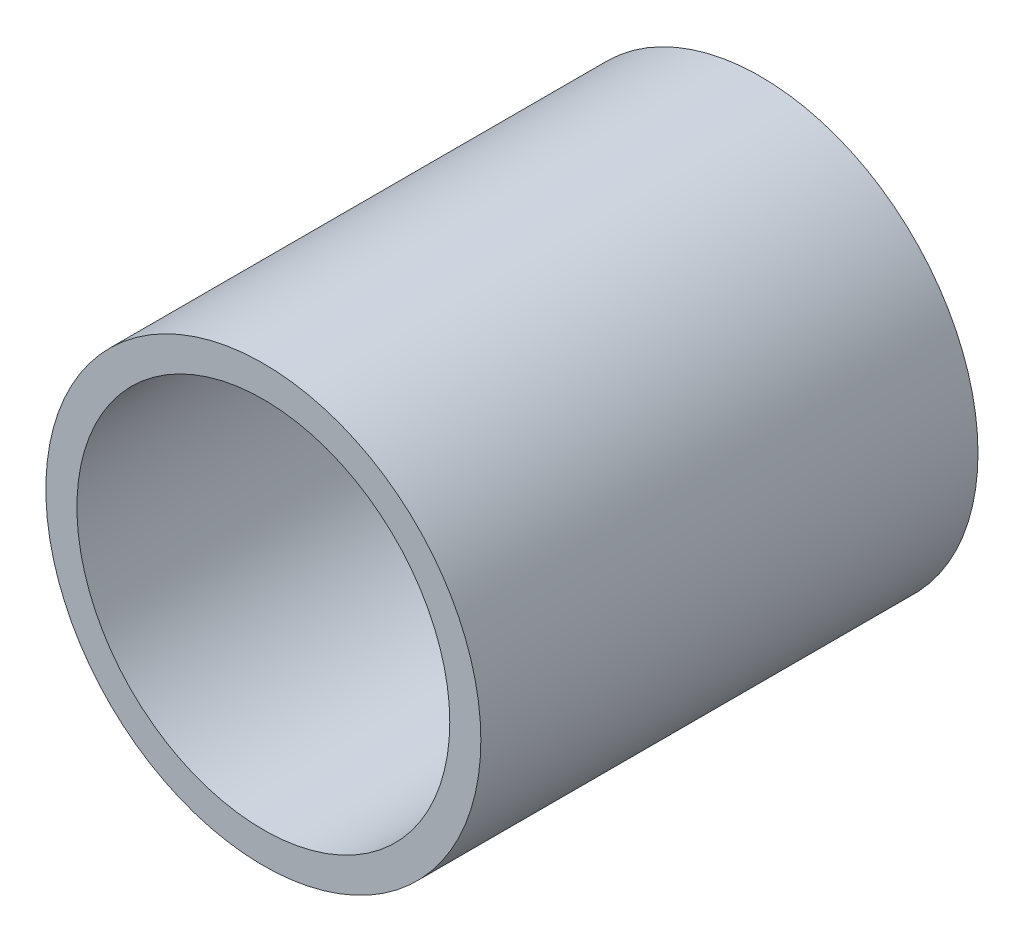
ISO-10303-21;
HEADER;
FILE_DESCRIPTION(('STEP AP214'),'2;1');
FILE_NAME('part.step','',(''),(''),'','','');
FILE_SCHEMA(('AUTOMOTIVE_DESIGN { 1 0 10303 214 1 1 1 1 }'));
ENDSEC;
DATA;
#1=APPLICATION_CONTEXT('core data for automotive mechanical design processes');
#2=APPLICATION_PROTOCOL_DEFINITION('international standard','automotive_design',2000,#1);
#3=PRODUCT_CONTEXT('',#1,'mechanical');
#4=PRODUCT('Part','Part','',(#3));
#5=PRODUCT_RELATED_PRODUCT_CATEGORY('part','',(#4));
#6=PRODUCT_DEFINITION_FORMATION('','',#4);
#7=PRODUCT_DEFINITION_CONTEXT('part definition',#1,'design');
#8=PRODUCT_DEFINITION('design','',#6,#7);
#9=PRODUCT_DEFINITION_SHAPE('','',#8);
#10=(LENGTH_UNIT() NAMED_UNIT(*) SI_UNIT(.MILLI.,.METRE.));
#11=(NAMED_UNIT(*) PLANE_ANGLE_UNIT() SI_UNIT($,.RADIAN.));
#12=(NAMED_UNIT(*) SI_UNIT($,.STERADIAN.) SOLID_ANGLE_UNIT());
#13=UNCERTAINTY_MEASURE_WITH_UNIT(LENGTH_MEASURE(1.E-05),#10,'distance_accuracy_value','');
#14=(GEOMETRIC_REPRESENTATION_CONTEXT(3) GLOBAL_UNCERTAINTY_ASSIGNED_CONTEXT((#13)) GLOBAL_UNIT_ASSIGNED_CONTEXT((#10,
#11,#12)) REPRESENTATION_CONTEXT('',''));
#15=CARTESIAN_POINT('',(0.,0.,0.));
#16=DIRECTION('',(0.,0.,1.));
#17=DIRECTION('',(1.,0.,0.));
#18=AXIS2_PLACEMENT_3D('',#15,#16,#17);
#19=CARTESIAN_POINT('',(0.,0.,4.));
#20=DIRECTION('',(0.,0.,1.));
#21=DIRECTION('',(1.,0.,0.));
#22=AXIS2_PLACEMENT_3D('',#19,#20,#21);
#23=PLANE('',#22);
#24=CARTESIAN_POINT('',(0.,0.,4.));
#25=DIRECTION('',(0.,0.,1.));
#26=DIRECTION('',(1.,0.,0.));
#27=AXIS2_PLACEMENT_3D('',#24,#25,#26);
#28=CIRCLE('',#27,1.75);
#29=CARTESIAN_POINT('',(1.75,0.,4.));
#30=VERTEX_POINT('',#29);
#31=EDGE_CURVE('E12',#30,#30,#28,.T.);
#32=ORIENTED_EDGE('',*,*,#31,.T.);
#33=EDGE_LOOP('',(#32));
#34=FACE_BOUND('',#33,.T.);
#35=CARTESIAN_POINT('',(0.,0.,4.));
#36=DIRECTION('',(0.,0.,1.));
#37=DIRECTION('',(1.,0.,0.));
#38=AXIS2_PLACEMENT_3D('',#35,#36,#37);
#39=CIRCLE('',#38,1.5);
#40=CARTESIAN_POINT('',(1.5,0.,4.));
#41=VERTEX_POINT('',#40);
#42=EDGE_CURVE('E53',#41,#41,#39,.T.);
#43=ORIENTED_EDGE('',*,*,#42,.F.);
#44=EDGE_LOOP('',(#43));
#45=FACE_BOUND('',#44,.T.);
#46=ADVANCED_FACE('F42',(#34,#45),#23,.T.);
#47=CARTESIAN_POINT('',(0.,0.,0.));
#48=DIRECTION('',(0.,0.,1.));
#49=DIRECTION('',(1.,0.,0.));
#50=AXIS2_PLACEMENT_3D('',#47,#48,#49);
#51=PLANE('',#50);
#52=CARTESIAN_POINT('',(0.,0.,0.));
#53=DIRECTION('',(0.,0.,1.));
#54=DIRECTION('',(1.,0.,0.));
#55=AXIS2_PLACEMENT_3D('',#52,#53,#54);
#56=CIRCLE('',#55,1.75);
#57=CARTESIAN_POINT('',(1.75,0.,0.));
#58=VERTEX_POINT('',#57);
#59=EDGE_CURVE('E46',#58,#58,#56,.T.);
#60=ORIENTED_EDGE('',*,*,#59,.F.);
#61=EDGE_LOOP('',(#60));
#62=FACE_BOUND('',#61,.T.);
#63=CARTESIAN_POINT('',(0.,0.,0.));
#64=DIRECTION('',(0.,0.,1.));
#65=DIRECTION('',(1.,0.,0.));
#66=AXIS2_PLACEMENT_3D('',#63,#64,#65);
#67=CIRCLE('',#66,1.5);
#68=CARTESIAN_POINT('',(1.5,0.,0.));
#69=VERTEX_POINT('',#68);
#70=EDGE_CURVE('E55',#69,#69,#67,.T.);
#71=ORIENTED_EDGE('',*,*,#70,.T.);
#72=EDGE_LOOP('',(#71));
#73=FACE_BOUND('',#72,.T.);
#74=ADVANCED_FACE('F65',(#62,#73),#51,.F.);
#75=CARTESIAN_POINT('',(0.,0.,4.));
#76=DIRECTION('',(0.,0.,-1.));
#77=DIRECTION('',(-1.,0.,0.));
#78=AXIS2_PLACEMENT_3D('',#75,#76,#77);
#79=CYLINDRICAL_SURFACE('',#78,1.75);
#80=ORIENTED_EDGE('',*,*,#31,.F.);
#81=EDGE_LOOP('',(#80));
#82=FACE_BOUND('',#81,.T.);
#83=ORIENTED_EDGE('',*,*,#59,.T.);
#84=EDGE_LOOP('',(#83));
#85=FACE_BOUND('',#84,.T.);
#86=ADVANCED_FACE('F44',(#82,#85),#79,.T.);
#87=CARTESIAN_POINT('',(0.,0.,4.));
#88=DIRECTION('',(0.,0.,-1.));
#89=DIRECTION('',(-1.,0.,0.));
#90=AXIS2_PLACEMENT_3D('',#87,#88,#89);
#91=CYLINDRICAL_SURFACE('',#90,1.5);
#92=ORIENTED_EDGE('',*,*,#42,.T.);
#93=EDGE_LOOP('',(#92));
#94=FACE_BOUND('',#93,.T.);
#95=ORIENTED_EDGE('',*,*,#70,.F.);
#96=EDGE_LOOP('',(#95));
#97=FACE_BOUND('',#96,.T.);
#98=ADVANCED_FACE('F61',(#94,#97),#91,.F.);
#99=CLOSED_SHELL('',(#46,#74,#86,#98));
#100=MANIFOLD_SOLID_BREP('B2',#99);
#101=ADVANCED_BREP_SHAPE_REPRESENTATION('',(#18,#100),#14);
#102=SHAPE_DEFINITION_REPRESENTATION(#9,#101);
ENDSEC;
END-ISO-10303-21;
